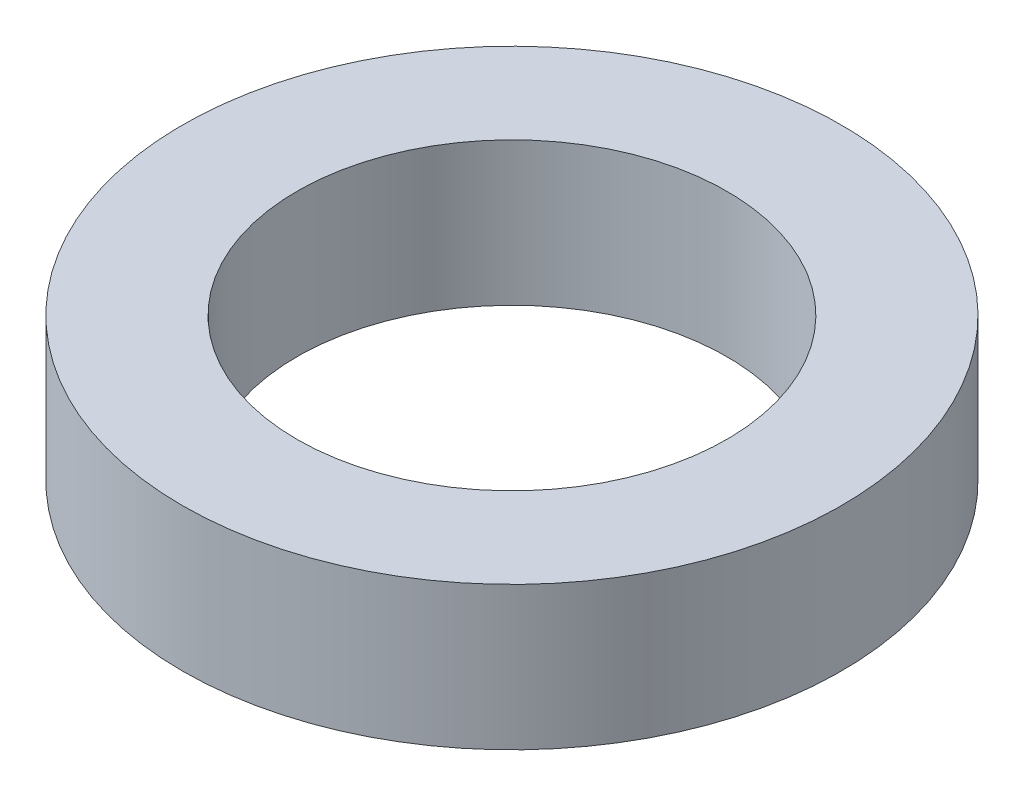
ISO-10303-21;
HEADER;
FILE_DESCRIPTION(('STEP AP214'),'2;1');
FILE_NAME('part.step','',(''),(''),'','','');
FILE_SCHEMA(('AUTOMOTIVE_DESIGN { 1 0 10303 214 1 1 1 1 }'));
ENDSEC;
DATA;
#1=APPLICATION_CONTEXT('core data for automotive mechanical design processes');
#2=APPLICATION_PROTOCOL_DEFINITION('international standard','automotive_design',2000,#1);
#3=PRODUCT_CONTEXT('',#1,'mechanical');
#4=PRODUCT('Part','Part','',(#3));
#5=PRODUCT_RELATED_PRODUCT_CATEGORY('part','',(#4));
#6=PRODUCT_DEFINITION_FORMATION('','',#4);
#7=PRODUCT_DEFINITION_CONTEXT('part definition',#1,'design');
#8=PRODUCT_DEFINITION('design','',#6,#7);
#9=PRODUCT_DEFINITION_SHAPE('','',#8);
#10=(LENGTH_UNIT() NAMED_UNIT(*) SI_UNIT(.MILLI.,.METRE.));
#11=(NAMED_UNIT(*) PLANE_ANGLE_UNIT() SI_UNIT($,.RADIAN.));
#12=(NAMED_UNIT(*) SI_UNIT($,.STERADIAN.) SOLID_ANGLE_UNIT());
#13=UNCERTAINTY_MEASURE_WITH_UNIT(LENGTH_MEASURE(1.E-05),#10,'distance_accuracy_value','');
#14=(GEOMETRIC_REPRESENTATION_CONTEXT(3) GLOBAL_UNCERTAINTY_ASSIGNED_CONTEXT((#13)) GLOBAL_UNIT_ASSIGNED_CONTEXT((#10,
#11,#12)) REPRESENTATION_CONTEXT('',''));
#15=CARTESIAN_POINT('',(0.,0.,0.));
#16=DIRECTION('',(0.,0.,1.));
#17=DIRECTION('',(1.,0.,0.));
#18=AXIS2_PLACEMENT_3D('',#15,#16,#17);
#19=CARTESIAN_POINT('',(0.,25.,0.));
#20=DIRECTION('',(0.,-1.,0.));
#21=DIRECTION('',(0.,0.,-1.));
#22=AXIS2_PLACEMENT_3D('',#19,#20,#21);
#23=CYLINDRICAL_SURFACE('',#22,57.5);
#24=CARTESIAN_POINT('',(0.,25.,0.));
#25=DIRECTION('',(0.,1.,0.));
#26=DIRECTION('',(0.,0.,1.));
#27=AXIS2_PLACEMENT_3D('',#24,#25,#26);
#28=CIRCLE('',#27,57.5);
#29=CARTESIAN_POINT('',(0.,25.,57.5));
#30=VERTEX_POINT('',#29);
#31=EDGE_CURVE('E10',#30,#30,#28,.T.);
#32=ORIENTED_EDGE('',*,*,#31,.F.);
#33=EDGE_LOOP('',(#32));
#34=FACE_BOUND('',#33,.T.);
#35=CARTESIAN_POINT('',(0.,0.,0.));
#36=DIRECTION('',(0.,1.,0.));
#37=DIRECTION('',(0.,0.,1.));
#38=AXIS2_PLACEMENT_3D('',#35,#36,#37);
#39=CIRCLE('',#38,57.5);
#40=CARTESIAN_POINT('',(0.,0.,57.5));
#41=VERTEX_POINT('',#40);
#42=EDGE_CURVE('E37',#41,#41,#39,.T.);
#43=ORIENTED_EDGE('',*,*,#42,.T.);
#44=EDGE_LOOP('',(#43));
#45=FACE_BOUND('',#44,.T.);
#46=ADVANCED_FACE('F40',(#34,#45),#23,.T.);
#47=CARTESIAN_POINT('',(0.,25.,0.));
#48=DIRECTION('',(0.,1.,0.));
#49=DIRECTION('',(0.,0.,1.));
#50=AXIS2_PLACEMENT_3D('',#47,#48,#49);
#51=PLANE('',#50);
#52=CARTESIAN_POINT('',(0.,25.,0.));
#53=DIRECTION('',(0.,1.,0.));
#54=DIRECTION('',(0.,0.,1.));
#55=AXIS2_PLACEMENT_3D('',#52,#53,#54);
#56=CIRCLE('',#55,37.5);
#57=CARTESIAN_POINT('',(0.,25.,37.5));
#58=VERTEX_POINT('',#57);
#59=EDGE_CURVE('E50',#58,#58,#56,.T.);
#60=ORIENTED_EDGE('',*,*,#59,.F.);
#61=EDGE_LOOP('',(#60));
#62=FACE_BOUND('',#61,.T.);
#63=ORIENTED_EDGE('',*,*,#31,.T.);
#64=EDGE_LOOP('',(#63));
#65=FACE_BOUND('',#64,.T.);
#66=ADVANCED_FACE('F59',(#62,#65),#51,.T.);
#67=CARTESIAN_POINT('',(0.,0.,0.));
#68=DIRECTION('',(0.,1.,0.));
#69=DIRECTION('',(0.,0.,1.));
#70=AXIS2_PLACEMENT_3D('',#67,#68,#69);
#71=PLANE('',#70);
#72=CARTESIAN_POINT('',(0.,0.,0.));
#73=DIRECTION('',(0.,1.,0.));
#74=DIRECTION('',(0.,0.,1.));
#75=AXIS2_PLACEMENT_3D('',#72,#73,#74);
#76=CIRCLE('',#75,37.5);
#77=CARTESIAN_POINT('',(0.,0.,37.5));
#78=VERTEX_POINT('',#77);
#79=EDGE_CURVE('E47',#78,#78,#76,.T.);
#80=ORIENTED_EDGE('',*,*,#79,.T.);
#81=EDGE_LOOP('',(#80));
#82=FACE_BOUND('',#81,.T.);
#83=ORIENTED_EDGE('',*,*,#42,.F.);
#84=EDGE_LOOP('',(#83));
#85=FACE_BOUND('',#84,.T.);
#86=ADVANCED_FACE('F58',(#82,#85),#71,.F.);
#87=CARTESIAN_POINT('',(0.,25.,0.));
#88=DIRECTION('',(0.,-1.,0.));
#89=DIRECTION('',(0.,0.,-1.));
#90=AXIS2_PLACEMENT_3D('',#87,#88,#89);
#91=CYLINDRICAL_SURFACE('',#90,37.5);
#92=ORIENTED_EDGE('',*,*,#59,.T.);
#93=EDGE_LOOP('',(#92));
#94=FACE_BOUND('',#93,.T.);
#95=ORIENTED_EDGE('',*,*,#79,.F.);
#96=EDGE_LOOP('',(#95));
#97=FACE_BOUND('',#96,.T.);
#98=ADVANCED_FACE('F54',(#94,#97),#91,.F.);
#99=CLOSED_SHELL('',(#46,#66,#86,#98));
#100=MANIFOLD_SOLID_BREP('B2',#99);
#101=ADVANCED_BREP_SHAPE_REPRESENTATION('',(#18,#100),#14);
#102=SHAPE_DEFINITION_REPRESENTATION(#9,#101);
ENDSEC;
END-ISO-10303-21;
